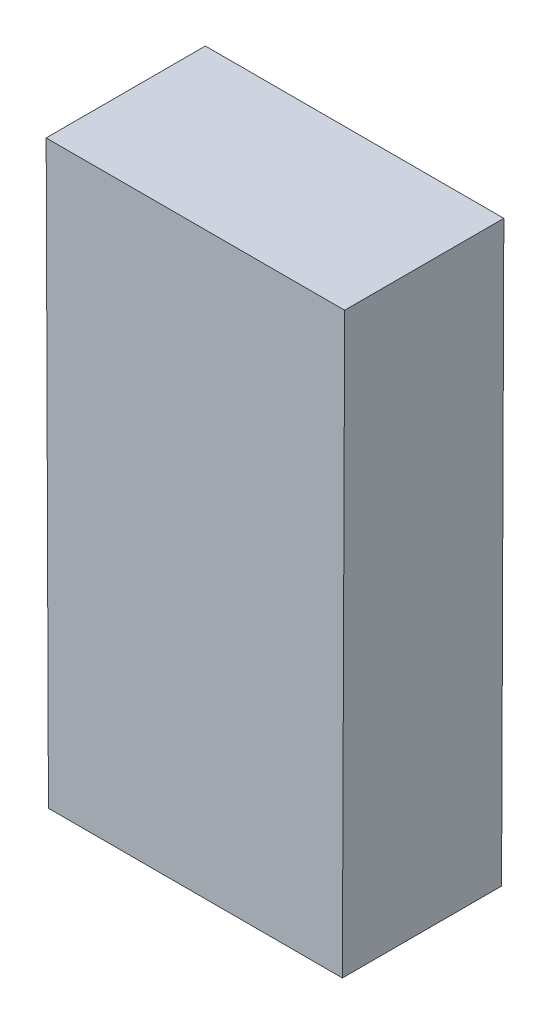
ISO-10303-21;
HEADER;
FILE_DESCRIPTION(('STEP AP214'),'2;1');
FILE_NAME('part.step','',(''),(''),'','','');
FILE_SCHEMA(('AUTOMOTIVE_DESIGN { 1 0 10303 214 1 1 1 1 }'));
ENDSEC;
DATA;
#1=APPLICATION_CONTEXT('core data for automotive mechanical design processes');
#2=APPLICATION_PROTOCOL_DEFINITION('international standard','automotive_design',2000,#1);
#3=PRODUCT_CONTEXT('',#1,'mechanical');
#4=PRODUCT('Part','Part','',(#3));
#5=PRODUCT_RELATED_PRODUCT_CATEGORY('part','',(#4));
#6=PRODUCT_DEFINITION_FORMATION('','',#4);
#7=PRODUCT_DEFINITION_CONTEXT('part definition',#1,'design');
#8=PRODUCT_DEFINITION('design','',#6,#7);
#9=PRODUCT_DEFINITION_SHAPE('','',#8);
#10=(LENGTH_UNIT() NAMED_UNIT(*) SI_UNIT(.MILLI.,.METRE.));
#11=(NAMED_UNIT(*) PLANE_ANGLE_UNIT() SI_UNIT($,.RADIAN.));
#12=(NAMED_UNIT(*) SI_UNIT($,.STERADIAN.) SOLID_ANGLE_UNIT());
#13=UNCERTAINTY_MEASURE_WITH_UNIT(LENGTH_MEASURE(1.E-05),#10,'distance_accuracy_value','');
#14=(GEOMETRIC_REPRESENTATION_CONTEXT(3) GLOBAL_UNCERTAINTY_ASSIGNED_CONTEXT((#13)) GLOBAL_UNIT_ASSIGNED_CONTEXT((#10,
#11,#12)) REPRESENTATION_CONTEXT('',''));
#15=CARTESIAN_POINT('',(0.,0.,0.));
#16=DIRECTION('',(0.,0.,1.));
#17=DIRECTION('',(1.,0.,0.));
#18=AXIS2_PLACEMENT_3D('',#15,#16,#17);
#19=CARTESIAN_POINT('',(0.73862946,-1.45595848,0.80000094));
#20=DIRECTION('',(0.,0.,1.));
#21=DIRECTION('',(1.,0.,0.));
#22=AXIS2_PLACEMENT_3D('',#19,#20,#21);
#23=PLANE('',#22);
#24=DIRECTION('',(0.00390341261863678,-0.999992381655945,0.));
#25=VECTOR('',#24,1.);
#26=CARTESIAN_POINT('',(-0.73863454,-1.45595848,0.80000094));
#27=LINE('',#26,#25);
#28=CARTESIAN_POINT('',(-0.73863454,-1.45595848,0.80000094));
#29=VERTEX_POINT('',#28);
#30=CARTESIAN_POINT('',(-0.750001039999999,1.45595848,0.80000094));
#31=VERTEX_POINT('',#30);
#32=EDGE_CURVE('E53',#29,#31,#27,.F.);
#33=ORIENTED_EDGE('',*,*,#32,.F.);
#34=DIRECTION('',(1.,0.,0.));
#35=VECTOR('',#34,1.);
#36=CARTESIAN_POINT('',(0.73862946,-1.45595848,0.80000094));
#37=LINE('',#36,#35);
#38=CARTESIAN_POINT('',(0.738629460000005,-1.45595848,0.80000094));
#39=VERTEX_POINT('',#38);
#40=EDGE_CURVE('E20',#29,#39,#37,.T.);
#41=ORIENTED_EDGE('',*,*,#40,.T.);
#42=DIRECTION('',(0.00390515713398625,0.999992374844808,0.));
#43=VECTOR('',#42,1.);
#44=CARTESIAN_POINT('',(0.75000104,1.45595848,0.80000094));
#45=LINE('',#44,#43);
#46=CARTESIAN_POINT('',(0.75000104,1.45595848,0.80000094));
#47=VERTEX_POINT('',#46);
#48=EDGE_CURVE('E67',#47,#39,#45,.F.);
#49=ORIENTED_EDGE('',*,*,#48,.F.);
#50=DIRECTION('',(1.,0.,0.));
#51=VECTOR('',#50,1.);
#52=CARTESIAN_POINT('',(-0.75000104,1.45595848,0.80000094));
#53=LINE('',#52,#51);
#54=EDGE_CURVE('E58',#31,#47,#53,.T.);
#55=ORIENTED_EDGE('',*,*,#54,.F.);
#56=EDGE_LOOP('',(#33,#41,#49,#55));
#57=FACE_BOUND('',#56,.T.);
#58=ADVANCED_FACE('F17',(#57),#23,.T.);
#59=CARTESIAN_POINT('',(0.75000104,1.45595848,0.));
#60=DIRECTION('',(0.999992374844808,-0.00390515713398625,0.));
#61=DIRECTION('',(0.00390515713398625,0.999992374844808,0.));
#62=AXIS2_PLACEMENT_3D('',#59,#60,#61);
#63=PLANE('',#62);
#64=DIRECTION('',(0.,0.,-1.));
#65=VECTOR('',#64,1.);
#66=CARTESIAN_POINT('',(0.73862946,-1.45595848,0.));
#67=LINE('',#66,#65);
#68=CARTESIAN_POINT('',(0.738629460000009,-1.45595848,0.));
#69=VERTEX_POINT('',#68);
#70=EDGE_CURVE('E80',#69,#39,#67,.F.);
#71=ORIENTED_EDGE('',*,*,#70,.F.);
#72=DIRECTION('',(0.00390515713399249,0.999992374844808,0.));
#73=VECTOR('',#72,1.);
#74=CARTESIAN_POINT('',(0.73862946,-1.45595848,0.));
#75=LINE('',#74,#73);
#76=CARTESIAN_POINT('',(0.75000104,1.45595848,0.));
#77=VERTEX_POINT('',#76);
#78=EDGE_CURVE('E75',#69,#77,#75,.T.);
#79=ORIENTED_EDGE('',*,*,#78,.T.);
#80=DIRECTION('',(0.,0.,1.));
#81=VECTOR('',#80,1.);
#82=CARTESIAN_POINT('',(0.75000104,1.45595848,0.));
#83=LINE('',#82,#81);
#84=EDGE_CURVE('E63',#47,#77,#83,.F.);
#85=ORIENTED_EDGE('',*,*,#84,.F.);
#86=ORIENTED_EDGE('',*,*,#48,.T.);
#87=EDGE_LOOP('',(#71,#79,#85,#86));
#88=FACE_BOUND('',#87,.T.);
#89=ADVANCED_FACE('F74',(#88),#63,.T.);
#90=CARTESIAN_POINT('',(-0.75000104,1.45595848,0.));
#91=DIRECTION('',(0.,1.,0.));
#92=DIRECTION('',(0.,0.,1.));
#93=AXIS2_PLACEMENT_3D('',#90,#91,#92);
#94=PLANE('',#93);
#95=ORIENTED_EDGE('',*,*,#84,.T.);
#96=DIRECTION('',(1.,0.,0.));
#97=VECTOR('',#96,1.);
#98=CARTESIAN_POINT('',(0.73862946,1.45595848,0.));
#99=LINE('',#98,#97);
#100=CARTESIAN_POINT('',(-0.750001039999999,1.45595848,0.));
#101=VERTEX_POINT('',#100);
#102=EDGE_CURVE('E84',#77,#101,#99,.F.);
#103=ORIENTED_EDGE('',*,*,#102,.T.);
#104=DIRECTION('',(0.,0.,1.));
#105=VECTOR('',#104,1.);
#106=CARTESIAN_POINT('',(-0.750001039999994,1.45595848,0.));
#107=LINE('',#106,#105);
#108=EDGE_CURVE('E65',#31,#101,#107,.F.);
#109=ORIENTED_EDGE('',*,*,#108,.F.);
#110=ORIENTED_EDGE('',*,*,#54,.T.);
#111=EDGE_LOOP('',(#95,#103,#109,#110));
#112=FACE_BOUND('',#111,.T.);
#113=ADVANCED_FACE('F60',(#112),#94,.T.);
#114=CARTESIAN_POINT('',(-0.73863454,-1.45595848,0.));
#115=DIRECTION('',(-0.999992381655945,-0.00390341261863678,0.));
#116=DIRECTION('',(0.00390341261863678,-0.999992381655945,0.));
#117=AXIS2_PLACEMENT_3D('',#114,#115,#116);
#118=PLANE('',#117);
#119=ORIENTED_EDGE('',*,*,#108,.T.);
#120=DIRECTION('',(0.00390341261863887,-0.999992381655945,0.));
#121=VECTOR('',#120,1.);
#122=CARTESIAN_POINT('',(-0.75000104,1.45595848,0.));
#123=LINE('',#122,#121);
#124=CARTESIAN_POINT('',(-0.73863454,-1.45595848,0.));
#125=VERTEX_POINT('',#124);
#126=EDGE_CURVE('E26',#101,#125,#123,.T.);
#127=ORIENTED_EDGE('',*,*,#126,.T.);
#128=DIRECTION('',(0.,0.,-1.));
#129=VECTOR('',#128,1.);
#130=CARTESIAN_POINT('',(-0.73863454,-1.45595848,0.));
#131=LINE('',#130,#129);
#132=EDGE_CURVE('E34',#29,#125,#131,.T.);
#133=ORIENTED_EDGE('',*,*,#132,.F.);
#134=ORIENTED_EDGE('',*,*,#32,.T.);
#135=EDGE_LOOP('',(#119,#127,#133,#134));
#136=FACE_BOUND('',#135,.T.);
#137=ADVANCED_FACE('F88',(#136),#118,.T.);
#138=CARTESIAN_POINT('',(0.73862946,-1.45595848,0.));
#139=DIRECTION('',(0.,-1.,0.));
#140=DIRECTION('',(0.,0.,-1.));
#141=AXIS2_PLACEMENT_3D('',#138,#139,#140);
#142=PLANE('',#141);
#143=ORIENTED_EDGE('',*,*,#132,.T.);
#144=DIRECTION('',(1.,0.,0.));
#145=VECTOR('',#144,1.);
#146=CARTESIAN_POINT('',(0.73862946,-1.45595848,0.));
#147=LINE('',#146,#145);
#148=EDGE_CURVE('E11',#125,#69,#147,.T.);
#149=ORIENTED_EDGE('',*,*,#148,.T.);
#150=ORIENTED_EDGE('',*,*,#70,.T.);
#151=ORIENTED_EDGE('',*,*,#40,.F.);
#152=EDGE_LOOP('',(#143,#149,#150,#151));
#153=FACE_BOUND('',#152,.T.);
#154=ADVANCED_FACE('F91',(#153),#142,.T.);
#155=CARTESIAN_POINT('',(0.73862946,-1.45595848,0.));
#156=DIRECTION('',(0.,0.,1.));
#157=DIRECTION('',(1.,0.,0.));
#158=AXIS2_PLACEMENT_3D('',#155,#156,#157);
#159=PLANE('',#158);
#160=ORIENTED_EDGE('',*,*,#126,.F.);
#161=ORIENTED_EDGE('',*,*,#102,.F.);
#162=ORIENTED_EDGE('',*,*,#78,.F.);
#163=ORIENTED_EDGE('',*,*,#148,.F.);
#164=EDGE_LOOP('',(#160,#161,#162,#163));
#165=FACE_BOUND('',#164,.T.);
#166=ADVANCED_FACE('F90',(#165),#159,.F.);
#167=CLOSED_SHELL('',(#58,#89,#113,#137,#154,#166));
#168=MANIFOLD_SOLID_BREP('B1',#167);
#169=ADVANCED_BREP_SHAPE_REPRESENTATION('',(#18,#168),#14);
#170=SHAPE_DEFINITION_REPRESENTATION(#9,#169);
ENDSEC;
END-ISO-10303-21;
